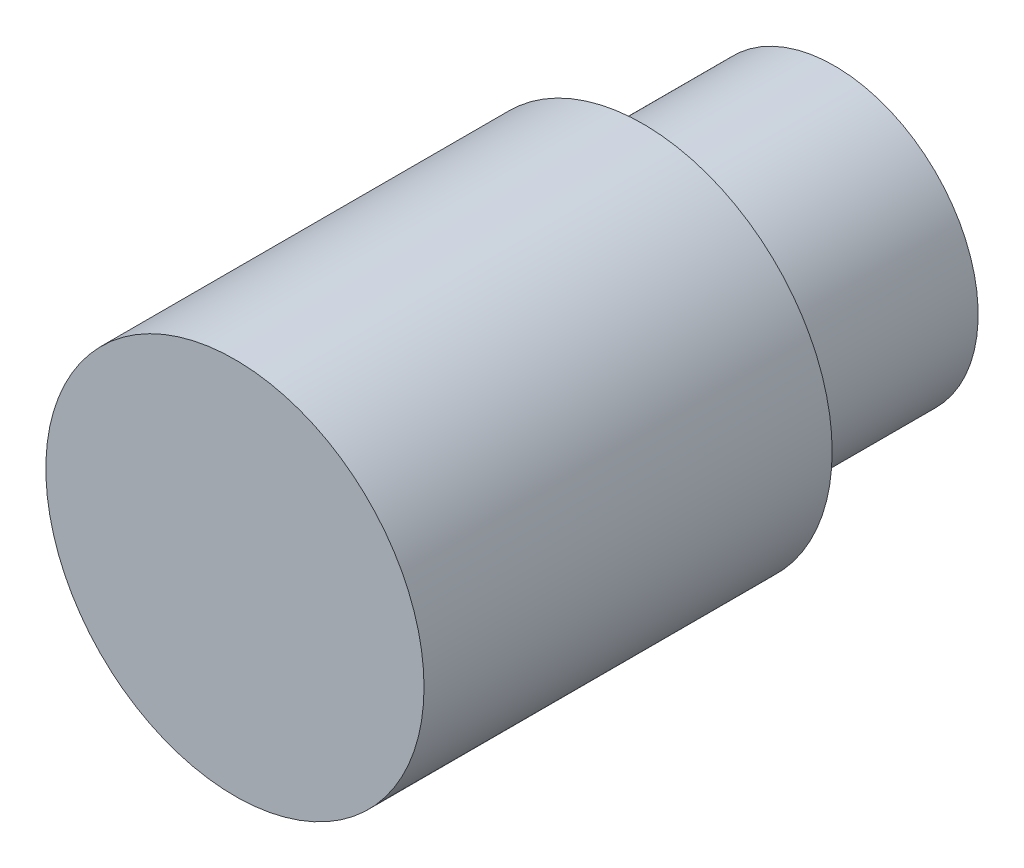
ISO-10303-21;
HEADER;
FILE_DESCRIPTION(('STEP AP214'),'2;1');
FILE_NAME('part.step','',(''),(''),'','','');
FILE_SCHEMA(('AUTOMOTIVE_DESIGN { 1 0 10303 214 1 1 1 1 }'));
ENDSEC;
DATA;
#1=APPLICATION_CONTEXT('core data for automotive mechanical design processes');
#2=APPLICATION_PROTOCOL_DEFINITION('international standard','automotive_design',2000,#1);
#3=PRODUCT_CONTEXT('',#1,'mechanical');
#4=PRODUCT('Part','Part','',(#3));
#5=PRODUCT_RELATED_PRODUCT_CATEGORY('part','',(#4));
#6=PRODUCT_DEFINITION_FORMATION('','',#4);
#7=PRODUCT_DEFINITION_CONTEXT('part definition',#1,'design');
#8=PRODUCT_DEFINITION('design','',#6,#7);
#9=PRODUCT_DEFINITION_SHAPE('','',#8);
#10=(LENGTH_UNIT() NAMED_UNIT(*) SI_UNIT(.MILLI.,.METRE.));
#11=(NAMED_UNIT(*) PLANE_ANGLE_UNIT() SI_UNIT($,.RADIAN.));
#12=(NAMED_UNIT(*) SI_UNIT($,.STERADIAN.) SOLID_ANGLE_UNIT());
#13=UNCERTAINTY_MEASURE_WITH_UNIT(LENGTH_MEASURE(1.E-05),#10,'distance_accuracy_value','');
#14=(GEOMETRIC_REPRESENTATION_CONTEXT(3) GLOBAL_UNCERTAINTY_ASSIGNED_CONTEXT((#13)) GLOBAL_UNIT_ASSIGNED_CONTEXT((#10,
#11,#12)) REPRESENTATION_CONTEXT('',''));
#15=CARTESIAN_POINT('',(0.,0.,0.));
#16=DIRECTION('',(0.,0.,1.));
#17=DIRECTION('',(1.,0.,0.));
#18=AXIS2_PLACEMENT_3D('',#15,#16,#17);
#19=CARTESIAN_POINT('',(0.,0.,-39.3945742854949));
#20=DIRECTION('',(0.,0.,1.));
#21=DIRECTION('',(1.,0.,0.));
#22=AXIS2_PLACEMENT_3D('',#19,#20,#21);
#23=CYLINDRICAL_SURFACE('',#22,7.9);
#24=CARTESIAN_POINT('',(0.,0.,-17.05));
#25=DIRECTION('',(0.,0.,1.));
#26=DIRECTION('',(1.,0.,0.));
#27=AXIS2_PLACEMENT_3D('',#24,#25,#26);
#28=CIRCLE('',#27,7.9);
#29=CARTESIAN_POINT('',(7.9,0.,-17.05));
#30=VERTEX_POINT('',#29);
#31=EDGE_CURVE('E47',#30,#30,#28,.F.);
#32=ORIENTED_EDGE('',*,*,#31,.F.);
#33=EDGE_LOOP('',(#32));
#34=FACE_BOUND('',#33,.T.);
#35=CARTESIAN_POINT('',(0.,0.,0.));
#36=DIRECTION('',(0.,0.,1.));
#37=DIRECTION('',(1.,0.,0.));
#38=AXIS2_PLACEMENT_3D('',#35,#36,#37);
#39=CIRCLE('',#38,7.9);
#40=CARTESIAN_POINT('',(7.9,0.,0.));
#41=VERTEX_POINT('',#40);
#42=EDGE_CURVE('E55',#41,#41,#39,.T.);
#43=ORIENTED_EDGE('',*,*,#42,.F.);
#44=EDGE_LOOP('',(#43));
#45=FACE_BOUND('',#44,.T.);
#46=ADVANCED_FACE('F44',(#34,#45),#23,.T.);
#47=CARTESIAN_POINT('',(0.,0.,0.));
#48=DIRECTION('',(0.,0.,1.));
#49=DIRECTION('',(1.,0.,0.));
#50=AXIS2_PLACEMENT_3D('',#47,#48,#49);
#51=PLANE('',#50);
#52=ORIENTED_EDGE('',*,*,#42,.T.);
#53=EDGE_LOOP('',(#52));
#54=FACE_BOUND('',#53,.T.);
#55=ADVANCED_FACE('F62',(#54),#51,.T.);
#56=CARTESIAN_POINT('',(-5.81590026784815,3.89554788987343,-17.05));
#57=DIRECTION('',(0.,0.,1.));
#58=DIRECTION('',(0.556474586487402,0.830864630727338,0.));
#59=AXIS2_PLACEMENT_3D('',#56,#57,#58);
#60=PLANE('',#59);
#61=CARTESIAN_POINT('',(0.000152147243220879,0.000225784461613254,-17.05));
#62=DIRECTION('',(0.,0.,-1.));
#63=DIRECTION('',(-1.,0.,0.));
#64=AXIS2_PLACEMENT_3D('',#61,#62,#63);
#65=CIRCLE('',#64,6.);
#66=CARTESIAN_POINT('',(-5.99984785275678,0.000225784461613254,-17.05));
#67=VERTEX_POINT('',#66);
#68=EDGE_CURVE('E12',#67,#67,#65,.T.);
#69=ORIENTED_EDGE('',*,*,#68,.F.);
#70=EDGE_LOOP('',(#69));
#71=FACE_BOUND('',#70,.T.);
#72=ORIENTED_EDGE('',*,*,#31,.T.);
#73=EDGE_LOOP('',(#72));
#74=FACE_BOUND('',#73,.T.);
#75=ADVANCED_FACE('F69',(#71,#74),#60,.F.);
#76=CARTESIAN_POINT('',(0.000152147243220879,0.000225784461613254,-42.0205627484771));
#77=DIRECTION('',(0.,0.,1.));
#78=DIRECTION('',(1.,0.,0.));
#79=AXIS2_PLACEMENT_3D('',#76,#77,#78);
#80=CYLINDRICAL_SURFACE('',#79,6.);
#81=ORIENTED_EDGE('',*,*,#68,.T.);
#82=EDGE_LOOP('',(#81));
#83=FACE_BOUND('',#82,.T.);
#84=CARTESIAN_POINT('',(0.000152147243220879,0.000225784461613254,-25.05));
#85=DIRECTION('',(0.,0.,-1.));
#86=DIRECTION('',(-1.,0.,0.));
#87=AXIS2_PLACEMENT_3D('',#84,#85,#86);
#88=CIRCLE('',#87,6.);
#89=CARTESIAN_POINT('',(-5.99984785275678,0.000225784461613254,-25.05));
#90=VERTEX_POINT('',#89);
#91=EDGE_CURVE('E57',#90,#90,#88,.T.);
#92=ORIENTED_EDGE('',*,*,#91,.F.);
#93=EDGE_LOOP('',(#92));
#94=FACE_BOUND('',#93,.T.);
#95=ADVANCED_FACE('F73',(#83,#94),#80,.T.);
#96=CARTESIAN_POINT('',(-10.8010880522122,7.23439540879783,-25.05));
#97=DIRECTION('',(0.,0.,-1.));
#98=DIRECTION('',(-0.556474586487402,-0.830864630727338,0.));
#99=AXIS2_PLACEMENT_3D('',#96,#97,#98);
#100=PLANE('',#99);
#101=ORIENTED_EDGE('',*,*,#91,.T.);
#102=EDGE_LOOP('',(#101));
#103=FACE_BOUND('',#102,.T.);
#104=ADVANCED_FACE('F79',(#103),#100,.T.);
#105=CLOSED_SHELL('',(#46,#55,#75,#95,#104));
#106=MANIFOLD_SOLID_BREP('B2',#105);
#107=ADVANCED_BREP_SHAPE_REPRESENTATION('',(#18,#106),#14);
#108=SHAPE_DEFINITION_REPRESENTATION(#9,#107);
ENDSEC;
END-ISO-10303-21;
